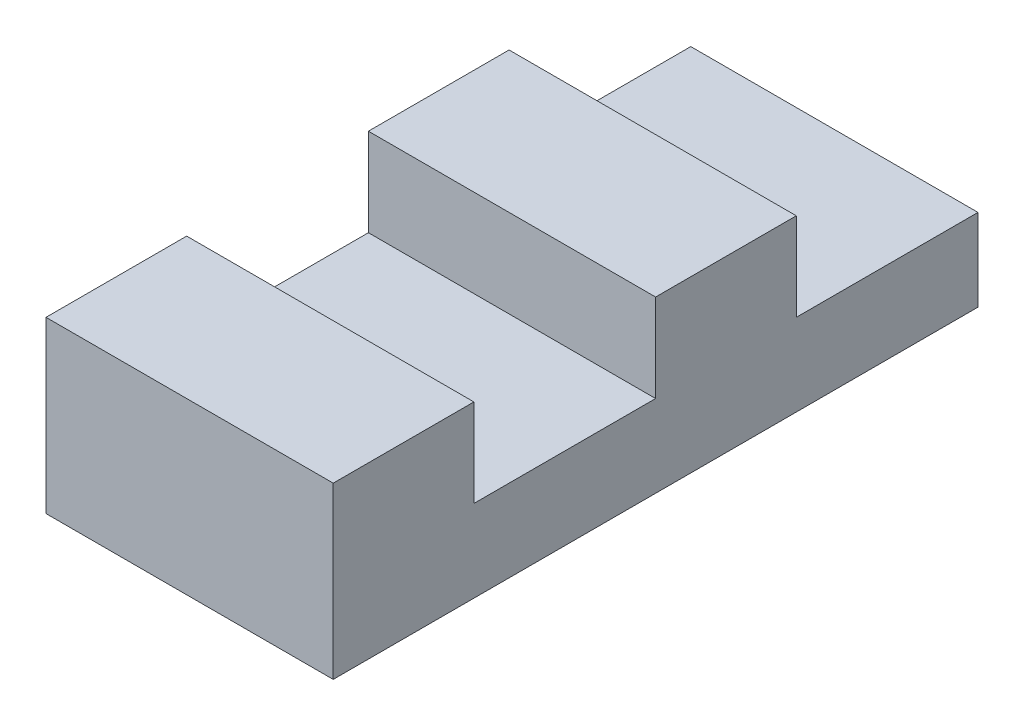
ISO-10303-21;
HEADER;
FILE_DESCRIPTION(('STEP AP214'),'2;1');
FILE_NAME('part.step','',(''),(''),'','','');
FILE_SCHEMA(('AUTOMOTIVE_DESIGN { 1 0 10303 214 1 1 1 1 }'));
ENDSEC;
DATA;
#1=APPLICATION_CONTEXT('core data for automotive mechanical design processes');
#2=APPLICATION_PROTOCOL_DEFINITION('international standard','automotive_design',2000,#1);
#3=PRODUCT_CONTEXT('',#1,'mechanical');
#4=PRODUCT('Part','Part','',(#3));
#5=PRODUCT_RELATED_PRODUCT_CATEGORY('part','',(#4));
#6=PRODUCT_DEFINITION_FORMATION('','',#4);
#7=PRODUCT_DEFINITION_CONTEXT('part definition',#1,'design');
#8=PRODUCT_DEFINITION('design','',#6,#7);
#9=PRODUCT_DEFINITION_SHAPE('','',#8);
#10=(LENGTH_UNIT() NAMED_UNIT(*) SI_UNIT(.MILLI.,.METRE.));
#11=(NAMED_UNIT(*) PLANE_ANGLE_UNIT() SI_UNIT($,.RADIAN.));
#12=(NAMED_UNIT(*) SI_UNIT($,.STERADIAN.) SOLID_ANGLE_UNIT());
#13=UNCERTAINTY_MEASURE_WITH_UNIT(LENGTH_MEASURE(1.E-05),#10,'distance_accuracy_value','');
#14=(GEOMETRIC_REPRESENTATION_CONTEXT(3) GLOBAL_UNCERTAINTY_ASSIGNED_CONTEXT((#13)) GLOBAL_UNIT_ASSIGNED_CONTEXT((#10,
#11,#12)) REPRESENTATION_CONTEXT('',''));
#15=CARTESIAN_POINT('',(0.,0.,0.));
#16=DIRECTION('',(0.,0.,1.));
#17=DIRECTION('',(1.,0.,0.));
#18=AXIS2_PLACEMENT_3D('',#15,#16,#17);
#19=CARTESIAN_POINT('',(9.8,0.,0.));
#20=DIRECTION('',(0.,0.,-1.));
#21=DIRECTION('',(-1.,0.,0.));
#22=AXIS2_PLACEMENT_3D('',#19,#20,#21);
#23=PLANE('',#22);
#24=DIRECTION('',(0.,-1.,0.));
#25=VECTOR('',#24,1.);
#26=CARTESIAN_POINT('',(0.,0.,0.));
#27=LINE('',#26,#25);
#28=CARTESIAN_POINT('',(0.,5.8,0.));
#29=VERTEX_POINT('',#28);
#30=CARTESIAN_POINT('',(0.,0.,0.));
#31=VERTEX_POINT('',#30);
#32=EDGE_CURVE('E131',#29,#31,#27,.T.);
#33=ORIENTED_EDGE('',*,*,#32,.T.);
#34=DIRECTION('',(-1.,0.,0.));
#35=VECTOR('',#34,1.);
#36=CARTESIAN_POINT('',(9.8,0.,0.));
#37=LINE('',#36,#35);
#38=CARTESIAN_POINT('',(9.8,0.,0.));
#39=VERTEX_POINT('',#38);
#40=EDGE_CURVE('E11',#39,#31,#37,.T.);
#41=ORIENTED_EDGE('',*,*,#40,.F.);
#42=DIRECTION('',(0.,-1.,0.));
#43=VECTOR('',#42,1.);
#44=CARTESIAN_POINT('',(9.8,0.,0.));
#45=LINE('',#44,#43);
#46=CARTESIAN_POINT('',(9.8,5.8,0.));
#47=VERTEX_POINT('',#46);
#48=EDGE_CURVE('E121',#47,#39,#45,.T.);
#49=ORIENTED_EDGE('',*,*,#48,.F.);
#50=DIRECTION('',(-1.,0.,0.));
#51=VECTOR('',#50,1.);
#52=CARTESIAN_POINT('',(9.8,5.8,0.));
#53=LINE('',#52,#51);
#54=EDGE_CURVE('E173',#47,#29,#53,.T.);
#55=ORIENTED_EDGE('',*,*,#54,.T.);
#56=EDGE_LOOP('',(#33,#41,#49,#55));
#57=FACE_BOUND('',#56,.T.);
#58=ADVANCED_FACE('F33',(#57),#23,.F.);
#59=CARTESIAN_POINT('',(9.8,0.,-4.8));
#60=DIRECTION('',(0.,1.,0.));
#61=DIRECTION('',(0.,0.,1.));
#62=AXIS2_PLACEMENT_3D('',#59,#60,#61);
#63=PLANE('',#62);
#64=DIRECTION('',(0.,0.,-1.));
#65=VECTOR('',#64,1.);
#66=CARTESIAN_POINT('',(0.,0.,-4.8));
#67=LINE('',#66,#65);
#68=CARTESIAN_POINT('',(0.,0.,-22.));
#69=VERTEX_POINT('',#68);
#70=EDGE_CURVE('E128',#31,#69,#67,.T.);
#71=ORIENTED_EDGE('',*,*,#70,.T.);
#72=DIRECTION('',(-1.,0.,0.));
#73=VECTOR('',#72,1.);
#74=CARTESIAN_POINT('',(9.8,0.,-22.));
#75=LINE('',#74,#73);
#76=CARTESIAN_POINT('',(9.8,0.,-22.));
#77=VERTEX_POINT('',#76);
#78=EDGE_CURVE('E126',#77,#69,#75,.T.);
#79=ORIENTED_EDGE('',*,*,#78,.F.);
#80=DIRECTION('',(0.,0.,-1.));
#81=VECTOR('',#80,1.);
#82=CARTESIAN_POINT('',(9.8,0.,0.));
#83=LINE('',#82,#81);
#84=EDGE_CURVE('E83',#39,#77,#83,.T.);
#85=ORIENTED_EDGE('',*,*,#84,.F.);
#86=ORIENTED_EDGE('',*,*,#40,.T.);
#87=EDGE_LOOP('',(#71,#79,#85,#86));
#88=FACE_BOUND('',#87,.T.);
#89=ADVANCED_FACE('F127',(#88),#63,.F.);
#90=CARTESIAN_POINT('',(9.8,2.8,-4.8));
#91=DIRECTION('',(0.,-1.,0.));
#92=DIRECTION('',(0.,0.,-1.));
#93=AXIS2_PLACEMENT_3D('',#90,#91,#92);
#94=PLANE('',#93);
#95=DIRECTION('',(0.,0.,1.));
#96=VECTOR('',#95,1.);
#97=CARTESIAN_POINT('',(0.,2.8,-4.8));
#98=LINE('',#97,#96);
#99=CARTESIAN_POINT('',(0.,2.8,-11.));
#100=VERTEX_POINT('',#99);
#101=CARTESIAN_POINT('',(0.,2.8,-4.8));
#102=VERTEX_POINT('',#101);
#103=EDGE_CURVE('E177',#100,#102,#98,.T.);
#104=ORIENTED_EDGE('',*,*,#103,.T.);
#105=DIRECTION('',(-1.,0.,0.));
#106=VECTOR('',#105,1.);
#107=CARTESIAN_POINT('',(9.8,2.8,-4.8));
#108=LINE('',#107,#106);
#109=CARTESIAN_POINT('',(9.8,2.8,-4.8));
#110=VERTEX_POINT('',#109);
#111=EDGE_CURVE('E184',#110,#102,#108,.T.);
#112=ORIENTED_EDGE('',*,*,#111,.F.);
#113=DIRECTION('',(0.,0.,1.));
#114=VECTOR('',#113,1.);
#115=CARTESIAN_POINT('',(9.8,2.8,-4.8));
#116=LINE('',#115,#114);
#117=CARTESIAN_POINT('',(9.8,2.8,-11.));
#118=VERTEX_POINT('',#117);
#119=EDGE_CURVE('E123',#118,#110,#116,.T.);
#120=ORIENTED_EDGE('',*,*,#119,.F.);
#121=DIRECTION('',(-1.,0.,0.));
#122=VECTOR('',#121,1.);
#123=CARTESIAN_POINT('',(9.8,2.8,-11.));
#124=LINE('',#123,#122);
#125=EDGE_CURVE('E41',#118,#100,#124,.T.);
#126=ORIENTED_EDGE('',*,*,#125,.T.);
#127=EDGE_LOOP('',(#104,#112,#120,#126));
#128=FACE_BOUND('',#127,.T.);
#129=ADVANCED_FACE('F189',(#128),#94,.F.);
#130=CARTESIAN_POINT('',(9.8,2.8,-4.8));
#131=DIRECTION('',(0.,0.,1.));
#132=DIRECTION('',(1.,0.,0.));
#133=AXIS2_PLACEMENT_3D('',#130,#131,#132);
#134=PLANE('',#133);
#135=DIRECTION('',(0.,1.,0.));
#136=VECTOR('',#135,1.);
#137=CARTESIAN_POINT('',(0.,2.8,-4.8));
#138=LINE('',#137,#136);
#139=CARTESIAN_POINT('',(0.,5.8,-4.8));
#140=VERTEX_POINT('',#139);
#141=EDGE_CURVE('E70',#102,#140,#138,.T.);
#142=ORIENTED_EDGE('',*,*,#141,.T.);
#143=DIRECTION('',(-1.,0.,0.));
#144=VECTOR('',#143,1.);
#145=CARTESIAN_POINT('',(9.8,5.8,-4.8));
#146=LINE('',#145,#144);
#147=CARTESIAN_POINT('',(9.8,5.8,-4.8));
#148=VERTEX_POINT('',#147);
#149=EDGE_CURVE('E182',#148,#140,#146,.T.);
#150=ORIENTED_EDGE('',*,*,#149,.F.);
#151=DIRECTION('',(0.,1.,0.));
#152=VECTOR('',#151,1.);
#153=CARTESIAN_POINT('',(9.8,2.8,-4.8));
#154=LINE('',#153,#152);
#155=EDGE_CURVE('E170',#110,#148,#154,.T.);
#156=ORIENTED_EDGE('',*,*,#155,.F.);
#157=ORIENTED_EDGE('',*,*,#111,.T.);
#158=EDGE_LOOP('',(#142,#150,#156,#157));
#159=FACE_BOUND('',#158,.T.);
#160=ADVANCED_FACE('F201',(#159),#134,.F.);
#161=CARTESIAN_POINT('',(9.8,5.8,0.));
#162=DIRECTION('',(0.,-1.,0.));
#163=DIRECTION('',(0.,0.,-1.));
#164=AXIS2_PLACEMENT_3D('',#161,#162,#163);
#165=PLANE('',#164);
#166=DIRECTION('',(0.,0.,1.));
#167=VECTOR('',#166,1.);
#168=CARTESIAN_POINT('',(0.,5.8,0.));
#169=LINE('',#168,#167);
#170=EDGE_CURVE('E76',#140,#29,#169,.T.);
#171=ORIENTED_EDGE('',*,*,#170,.T.);
#172=ORIENTED_EDGE('',*,*,#54,.F.);
#173=DIRECTION('',(0.,0.,1.));
#174=VECTOR('',#173,1.);
#175=CARTESIAN_POINT('',(9.8,5.8,0.));
#176=LINE('',#175,#174);
#177=EDGE_CURVE('E49',#148,#47,#176,.T.);
#178=ORIENTED_EDGE('',*,*,#177,.F.);
#179=ORIENTED_EDGE('',*,*,#149,.T.);
#180=EDGE_LOOP('',(#171,#172,#178,#179));
#181=FACE_BOUND('',#180,.T.);
#182=ADVANCED_FACE('F199',(#181),#165,.F.);
#183=CARTESIAN_POINT('',(9.8,0.,0.));
#184=DIRECTION('',(-1.,0.,0.));
#185=DIRECTION('',(0.,0.,1.));
#186=AXIS2_PLACEMENT_3D('',#183,#184,#185);
#187=PLANE('',#186);
#188=ORIENTED_EDGE('',*,*,#48,.T.);
#189=ORIENTED_EDGE('',*,*,#84,.T.);
#190=DIRECTION('',(0.,1.,0.));
#191=VECTOR('',#190,1.);
#192=CARTESIAN_POINT('',(9.8,0.,-22.));
#193=LINE('',#192,#191);
#194=CARTESIAN_POINT('',(9.8,2.8,-22.));
#195=VERTEX_POINT('',#194);
#196=EDGE_CURVE('E118',#77,#195,#193,.T.);
#197=ORIENTED_EDGE('',*,*,#196,.T.);
#198=DIRECTION('',(0.,0.,1.));
#199=VECTOR('',#198,1.);
#200=CARTESIAN_POINT('',(9.8,2.8,-15.8));
#201=LINE('',#200,#199);
#202=CARTESIAN_POINT('',(9.8,2.8,-15.8));
#203=VERTEX_POINT('',#202);
#204=EDGE_CURVE('E137',#195,#203,#201,.T.);
#205=ORIENTED_EDGE('',*,*,#204,.T.);
#206=DIRECTION('',(0.,1.,0.));
#207=VECTOR('',#206,1.);
#208=CARTESIAN_POINT('',(9.8,2.8,-15.8));
#209=LINE('',#208,#207);
#210=CARTESIAN_POINT('',(9.8,5.8,-15.8));
#211=VERTEX_POINT('',#210);
#212=EDGE_CURVE('E140',#203,#211,#209,.T.);
#213=ORIENTED_EDGE('',*,*,#212,.T.);
#214=DIRECTION('',(0.,0.,1.));
#215=VECTOR('',#214,1.);
#216=CARTESIAN_POINT('',(9.8,5.8,-11.));
#217=LINE('',#216,#215);
#218=CARTESIAN_POINT('',(9.8,5.8,-11.));
#219=VERTEX_POINT('',#218);
#220=EDGE_CURVE('E147',#211,#219,#217,.T.);
#221=ORIENTED_EDGE('',*,*,#220,.T.);
#222=DIRECTION('',(0.,-1.,0.));
#223=VECTOR('',#222,1.);
#224=CARTESIAN_POINT('',(9.8,0.,-11.));
#225=LINE('',#224,#223);
#226=EDGE_CURVE('E138',#219,#118,#225,.T.);
#227=ORIENTED_EDGE('',*,*,#226,.T.);
#228=ORIENTED_EDGE('',*,*,#119,.T.);
#229=ORIENTED_EDGE('',*,*,#155,.T.);
#230=ORIENTED_EDGE('',*,*,#177,.T.);
#231=EDGE_LOOP('',(#188,#189,#197,#205,#213,#221,#227,#228,#229,#230));
#232=FACE_BOUND('',#231,.T.);
#233=ADVANCED_FACE('F116',(#232),#187,.F.);
#234=CARTESIAN_POINT('',(0.,0.,0.));
#235=DIRECTION('',(-1.,0.,0.));
#236=DIRECTION('',(0.,0.,1.));
#237=AXIS2_PLACEMENT_3D('',#234,#235,#236);
#238=PLANE('',#237);
#239=ORIENTED_EDGE('',*,*,#32,.F.);
#240=ORIENTED_EDGE('',*,*,#170,.F.);
#241=ORIENTED_EDGE('',*,*,#141,.F.);
#242=ORIENTED_EDGE('',*,*,#103,.F.);
#243=DIRECTION('',(0.,-1.,0.));
#244=VECTOR('',#243,1.);
#245=CARTESIAN_POINT('',(0.,0.,-11.));
#246=LINE('',#245,#244);
#247=CARTESIAN_POINT('',(0.,5.8,-11.));
#248=VERTEX_POINT('',#247);
#249=EDGE_CURVE('E150',#248,#100,#246,.T.);
#250=ORIENTED_EDGE('',*,*,#249,.F.);
#251=DIRECTION('',(0.,0.,1.));
#252=VECTOR('',#251,1.);
#253=CARTESIAN_POINT('',(0.,5.8,-11.));
#254=LINE('',#253,#252);
#255=CARTESIAN_POINT('',(0.,5.8,-15.8));
#256=VERTEX_POINT('',#255);
#257=EDGE_CURVE('E143',#256,#248,#254,.T.);
#258=ORIENTED_EDGE('',*,*,#257,.F.);
#259=DIRECTION('',(0.,1.,0.));
#260=VECTOR('',#259,1.);
#261=CARTESIAN_POINT('',(0.,2.8,-15.8));
#262=LINE('',#261,#260);
#263=CARTESIAN_POINT('',(0.,2.8,-15.8));
#264=VERTEX_POINT('',#263);
#265=EDGE_CURVE('E156',#264,#256,#262,.T.);
#266=ORIENTED_EDGE('',*,*,#265,.F.);
#267=DIRECTION('',(0.,0.,1.));
#268=VECTOR('',#267,1.);
#269=CARTESIAN_POINT('',(0.,2.8,-15.8));
#270=LINE('',#269,#268);
#271=CARTESIAN_POINT('',(0.,2.8,-22.));
#272=VERTEX_POINT('',#271);
#273=EDGE_CURVE('E154',#272,#264,#270,.T.);
#274=ORIENTED_EDGE('',*,*,#273,.F.);
#275=DIRECTION('',(0.,1.,0.));
#276=VECTOR('',#275,1.);
#277=CARTESIAN_POINT('',(0.,0.,-22.));
#278=LINE('',#277,#276);
#279=EDGE_CURVE('E152',#69,#272,#278,.T.);
#280=ORIENTED_EDGE('',*,*,#279,.F.);
#281=ORIENTED_EDGE('',*,*,#70,.F.);
#282=EDGE_LOOP('',(#239,#240,#241,#242,#250,#258,#266,#274,#280,#281));
#283=FACE_BOUND('',#282,.T.);
#284=ADVANCED_FACE('F196',(#283),#238,.T.);
#285=CARTESIAN_POINT('',(9.8,0.,-11.));
#286=DIRECTION('',(0.,0.,-1.));
#287=DIRECTION('',(-1.,0.,0.));
#288=AXIS2_PLACEMENT_3D('',#285,#286,#287);
#289=PLANE('',#288);
#290=ORIENTED_EDGE('',*,*,#125,.F.);
#291=ORIENTED_EDGE('',*,*,#226,.F.);
#292=DIRECTION('',(-1.,0.,0.));
#293=VECTOR('',#292,1.);
#294=CARTESIAN_POINT('',(9.8,5.8,-11.));
#295=LINE('',#294,#293);
#296=EDGE_CURVE('E149',#219,#248,#295,.T.);
#297=ORIENTED_EDGE('',*,*,#296,.T.);
#298=ORIENTED_EDGE('',*,*,#249,.T.);
#299=EDGE_LOOP('',(#290,#291,#297,#298));
#300=FACE_BOUND('',#299,.T.);
#301=ADVANCED_FACE('F204',(#300),#289,.F.);
#302=CARTESIAN_POINT('',(9.8,0.,-22.));
#303=DIRECTION('',(0.,0.,1.));
#304=DIRECTION('',(1.,0.,0.));
#305=AXIS2_PLACEMENT_3D('',#302,#303,#304);
#306=PLANE('',#305);
#307=ORIENTED_EDGE('',*,*,#279,.T.);
#308=DIRECTION('',(-1.,0.,0.));
#309=VECTOR('',#308,1.);
#310=CARTESIAN_POINT('',(9.8,2.8,-22.));
#311=LINE('',#310,#309);
#312=EDGE_CURVE('E132',#195,#272,#311,.T.);
#313=ORIENTED_EDGE('',*,*,#312,.F.);
#314=ORIENTED_EDGE('',*,*,#196,.F.);
#315=ORIENTED_EDGE('',*,*,#78,.T.);
#316=EDGE_LOOP('',(#307,#313,#314,#315));
#317=FACE_BOUND('',#316,.T.);
#318=ADVANCED_FACE('F134',(#317),#306,.F.);
#319=CARTESIAN_POINT('',(9.8,2.8,-15.8));
#320=DIRECTION('',(0.,-1.,0.));
#321=DIRECTION('',(0.,0.,-1.));
#322=AXIS2_PLACEMENT_3D('',#319,#320,#321);
#323=PLANE('',#322);
#324=ORIENTED_EDGE('',*,*,#273,.T.);
#325=DIRECTION('',(-1.,0.,0.));
#326=VECTOR('',#325,1.);
#327=CARTESIAN_POINT('',(9.8,2.8,-15.8));
#328=LINE('',#327,#326);
#329=EDGE_CURVE('E164',#203,#264,#328,.T.);
#330=ORIENTED_EDGE('',*,*,#329,.F.);
#331=ORIENTED_EDGE('',*,*,#204,.F.);
#332=ORIENTED_EDGE('',*,*,#312,.T.);
#333=EDGE_LOOP('',(#324,#330,#331,#332));
#334=FACE_BOUND('',#333,.T.);
#335=ADVANCED_FACE('F215',(#334),#323,.F.);
#336=CARTESIAN_POINT('',(9.8,2.8,-15.8));
#337=DIRECTION('',(0.,0.,1.));
#338=DIRECTION('',(1.,0.,0.));
#339=AXIS2_PLACEMENT_3D('',#336,#337,#338);
#340=PLANE('',#339);
#341=ORIENTED_EDGE('',*,*,#265,.T.);
#342=DIRECTION('',(-1.,0.,0.));
#343=VECTOR('',#342,1.);
#344=CARTESIAN_POINT('',(9.8,5.8,-15.8));
#345=LINE('',#344,#343);
#346=EDGE_CURVE('E161',#211,#256,#345,.T.);
#347=ORIENTED_EDGE('',*,*,#346,.F.);
#348=ORIENTED_EDGE('',*,*,#212,.F.);
#349=ORIENTED_EDGE('',*,*,#329,.T.);
#350=EDGE_LOOP('',(#341,#347,#348,#349));
#351=FACE_BOUND('',#350,.T.);
#352=ADVANCED_FACE('F211',(#351),#340,.F.);
#353=CARTESIAN_POINT('',(9.8,5.8,-11.));
#354=DIRECTION('',(0.,-1.,0.));
#355=DIRECTION('',(0.,0.,-1.));
#356=AXIS2_PLACEMENT_3D('',#353,#354,#355);
#357=PLANE('',#356);
#358=ORIENTED_EDGE('',*,*,#257,.T.);
#359=ORIENTED_EDGE('',*,*,#296,.F.);
#360=ORIENTED_EDGE('',*,*,#220,.F.);
#361=ORIENTED_EDGE('',*,*,#346,.T.);
#362=EDGE_LOOP('',(#358,#359,#360,#361));
#363=FACE_BOUND('',#362,.T.);
#364=ADVANCED_FACE('F206',(#363),#357,.F.);
#365=CLOSED_SHELL('',(#58,#89,#129,#160,#182,#233,#284,#301,#318,#335,#352,#364));
#366=MANIFOLD_SOLID_BREP('B2',#365);
#367=ADVANCED_BREP_SHAPE_REPRESENTATION('',(#18,#366),#14);
#368=SHAPE_DEFINITION_REPRESENTATION(#9,#367);
ENDSEC;
END-ISO-10303-21;
